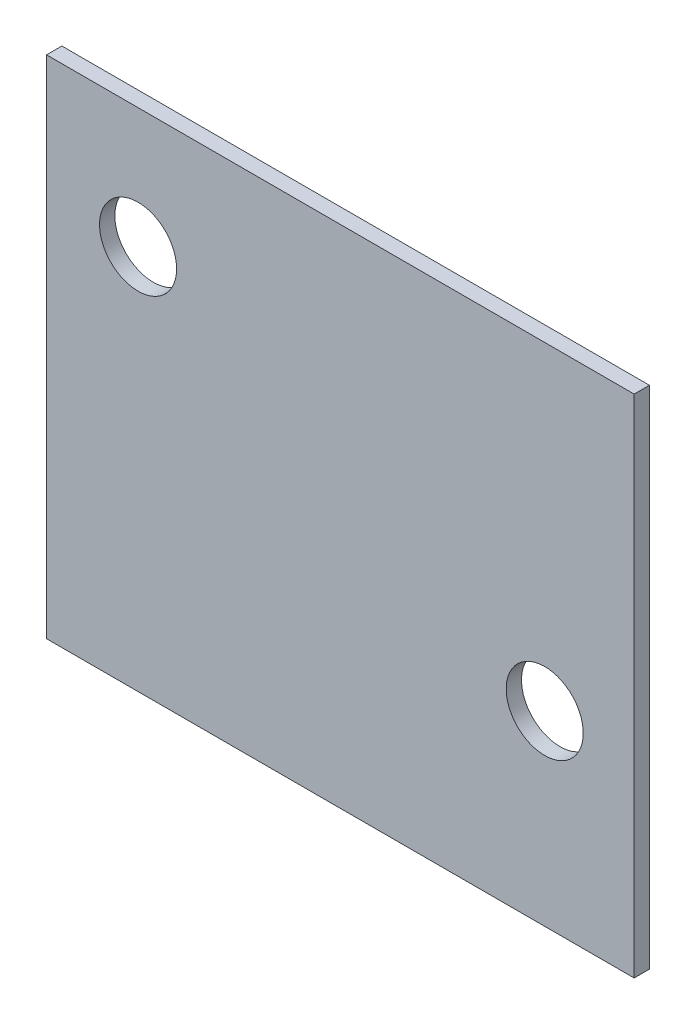
ISO-10303-21;
HEADER;
FILE_DESCRIPTION(('STEP AP214'),'2;1');
FILE_NAME('part.step','',(''),(''),'','','');
FILE_SCHEMA(('AUTOMOTIVE_DESIGN { 1 0 10303 214 1 1 1 1 }'));
ENDSEC;
DATA;
#1=APPLICATION_CONTEXT('core data for automotive mechanical design processes');
#2=APPLICATION_PROTOCOL_DEFINITION('international standard','automotive_design',2000,#1);
#3=PRODUCT_CONTEXT('',#1,'mechanical');
#4=PRODUCT('Part','Part','',(#3));
#5=PRODUCT_RELATED_PRODUCT_CATEGORY('part','',(#4));
#6=PRODUCT_DEFINITION_FORMATION('','',#4);
#7=PRODUCT_DEFINITION_CONTEXT('part definition',#1,'design');
#8=PRODUCT_DEFINITION('design','',#6,#7);
#9=PRODUCT_DEFINITION_SHAPE('','',#8);
#10=(LENGTH_UNIT() NAMED_UNIT(*) SI_UNIT(.MILLI.,.METRE.));
#11=(NAMED_UNIT(*) PLANE_ANGLE_UNIT() SI_UNIT($,.RADIAN.));
#12=(NAMED_UNIT(*) SI_UNIT($,.STERADIAN.) SOLID_ANGLE_UNIT());
#13=UNCERTAINTY_MEASURE_WITH_UNIT(LENGTH_MEASURE(1.E-05),#10,'distance_accuracy_value','');
#14=(GEOMETRIC_REPRESENTATION_CONTEXT(3) GLOBAL_UNCERTAINTY_ASSIGNED_CONTEXT((#13)) GLOBAL_UNIT_ASSIGNED_CONTEXT((#10,
#11,#12)) REPRESENTATION_CONTEXT('',''));
#15=CARTESIAN_POINT('',(0.,0.,0.));
#16=DIRECTION('',(0.,0.,1.));
#17=DIRECTION('',(1.,0.,0.));
#18=AXIS2_PLACEMENT_3D('',#15,#16,#17);
#19=CARTESIAN_POINT('',(103.,-80.,-3.175));
#20=DIRECTION('',(1.,0.,0.));
#21=DIRECTION('',(0.,0.,-1.));
#22=AXIS2_PLACEMENT_3D('',#19,#20,#21);
#23=PLANE('',#22);
#24=DIRECTION('',(0.,1.,0.));
#25=VECTOR('',#24,1.);
#26=CARTESIAN_POINT('',(103.,-80.,0.));
#27=LINE('',#26,#25);
#28=CARTESIAN_POINT('',(103.,-80.,0.));
#29=VERTEX_POINT('',#28);
#30=CARTESIAN_POINT('',(103.,24.9999999999998,0.));
#31=VERTEX_POINT('',#30);
#32=EDGE_CURVE('E98',#29,#31,#27,.T.);
#33=ORIENTED_EDGE('',*,*,#32,.F.);
#34=DIRECTION('',(0.,0.,1.));
#35=VECTOR('',#34,1.);
#36=CARTESIAN_POINT('',(103.,-80.,-3.175));
#37=LINE('',#36,#35);
#38=CARTESIAN_POINT('',(103.,-80.,-3.175));
#39=VERTEX_POINT('',#38);
#40=EDGE_CURVE('E11',#39,#29,#37,.T.);
#41=ORIENTED_EDGE('',*,*,#40,.F.);
#42=DIRECTION('',(0.,1.,0.));
#43=VECTOR('',#42,1.);
#44=CARTESIAN_POINT('',(103.,-80.,-3.175));
#45=LINE('',#44,#43);
#46=CARTESIAN_POINT('',(103.,24.9999999999998,-3.175));
#47=VERTEX_POINT('',#46);
#48=EDGE_CURVE('E91',#39,#47,#45,.T.);
#49=ORIENTED_EDGE('',*,*,#48,.T.);
#50=DIRECTION('',(0.,0.,1.));
#51=VECTOR('',#50,1.);
#52=CARTESIAN_POINT('',(103.,24.9999999999998,-3.175));
#53=LINE('',#52,#51);
#54=EDGE_CURVE('E36',#47,#31,#53,.T.);
#55=ORIENTED_EDGE('',*,*,#54,.T.);
#56=EDGE_LOOP('',(#33,#41,#49,#55));
#57=FACE_BOUND('',#56,.T.);
#58=ADVANCED_FACE('F33',(#57),#23,.T.);
#59=CARTESIAN_POINT('',(103.,-80.,-3.175));
#60=DIRECTION('',(0.,-1.,0.));
#61=DIRECTION('',(1.,0.,0.));
#62=AXIS2_PLACEMENT_3D('',#59,#60,#61);
#63=PLANE('',#62);
#64=DIRECTION('',(1.,0.,0.));
#65=VECTOR('',#64,1.);
#66=CARTESIAN_POINT('',(103.,-80.,0.));
#67=LINE('',#66,#65);
#68=CARTESIAN_POINT('',(-19.,-80.,0.));
#69=VERTEX_POINT('',#68);
#70=EDGE_CURVE('E93',#69,#29,#67,.T.);
#71=ORIENTED_EDGE('',*,*,#70,.F.);
#72=DIRECTION('',(0.,0.,1.));
#73=VECTOR('',#72,1.);
#74=CARTESIAN_POINT('',(-19.,-80.,-3.175));
#75=LINE('',#74,#73);
#76=CARTESIAN_POINT('',(-19.,-80.,-3.175));
#77=VERTEX_POINT('',#76);
#78=EDGE_CURVE('E42',#77,#69,#75,.T.);
#79=ORIENTED_EDGE('',*,*,#78,.F.);
#80=DIRECTION('',(1.,0.,0.));
#81=VECTOR('',#80,1.);
#82=CARTESIAN_POINT('',(103.,-80.,-3.175));
#83=LINE('',#82,#81);
#84=EDGE_CURVE('E88',#77,#39,#83,.T.);
#85=ORIENTED_EDGE('',*,*,#84,.T.);
#86=ORIENTED_EDGE('',*,*,#40,.T.);
#87=EDGE_LOOP('',(#71,#79,#85,#86));
#88=FACE_BOUND('',#87,.T.);
#89=ADVANCED_FACE('F109',(#88),#63,.T.);
#90=CARTESIAN_POINT('',(-19.,-80.,-3.175));
#91=DIRECTION('',(-1.,0.,0.));
#92=DIRECTION('',(0.,-1.,0.));
#93=AXIS2_PLACEMENT_3D('',#90,#91,#92);
#94=PLANE('',#93);
#95=DIRECTION('',(0.,-1.,0.));
#96=VECTOR('',#95,1.);
#97=CARTESIAN_POINT('',(-19.,-80.,0.));
#98=LINE('',#97,#96);
#99=CARTESIAN_POINT('',(-19.,24.9999999999998,0.));
#100=VERTEX_POINT('',#99);
#101=EDGE_CURVE('E83',#100,#69,#98,.T.);
#102=ORIENTED_EDGE('',*,*,#101,.F.);
#103=DIRECTION('',(0.,0.,1.));
#104=VECTOR('',#103,1.);
#105=CARTESIAN_POINT('',(-19.,24.9999999999998,-3.175));
#106=LINE('',#105,#104);
#107=CARTESIAN_POINT('',(-19.,24.9999999999998,-3.175));
#108=VERTEX_POINT('',#107);
#109=EDGE_CURVE('E78',#108,#100,#106,.T.);
#110=ORIENTED_EDGE('',*,*,#109,.F.);
#111=DIRECTION('',(0.,-1.,0.));
#112=VECTOR('',#111,1.);
#113=CARTESIAN_POINT('',(-19.,-80.,-3.175));
#114=LINE('',#113,#112);
#115=EDGE_CURVE('E81',#108,#77,#114,.T.);
#116=ORIENTED_EDGE('',*,*,#115,.T.);
#117=ORIENTED_EDGE('',*,*,#78,.T.);
#118=EDGE_LOOP('',(#102,#110,#116,#117));
#119=FACE_BOUND('',#118,.T.);
#120=ADVANCED_FACE('F80',(#119),#94,.T.);
#121=CARTESIAN_POINT('',(103.,24.9999999999998,-3.175));
#122=DIRECTION('',(0.,1.,0.));
#123=DIRECTION('',(-1.,0.,0.));
#124=AXIS2_PLACEMENT_3D('',#121,#122,#123);
#125=PLANE('',#124);
#126=DIRECTION('',(-1.,0.,0.));
#127=VECTOR('',#126,1.);
#128=CARTESIAN_POINT('',(103.,24.9999999999998,0.));
#129=LINE('',#128,#127);
#130=EDGE_CURVE('E101',#31,#100,#129,.T.);
#131=ORIENTED_EDGE('',*,*,#130,.F.);
#132=ORIENTED_EDGE('',*,*,#54,.F.);
#133=DIRECTION('',(-1.,0.,0.));
#134=VECTOR('',#133,1.);
#135=CARTESIAN_POINT('',(103.,24.9999999999998,-3.175));
#136=LINE('',#135,#134);
#137=EDGE_CURVE('E87',#47,#108,#136,.T.);
#138=ORIENTED_EDGE('',*,*,#137,.T.);
#139=ORIENTED_EDGE('',*,*,#109,.T.);
#140=EDGE_LOOP('',(#131,#132,#138,#139));
#141=FACE_BOUND('',#140,.T.);
#142=ADVANCED_FACE('F90',(#141),#125,.T.);
#143=CARTESIAN_POINT('',(0.,0.,-3.175));
#144=DIRECTION('',(0.,0.,1.));
#145=DIRECTION('',(1.,0.,0.));
#146=AXIS2_PLACEMENT_3D('',#143,#144,#145);
#147=PLANE('',#146);
#148=CARTESIAN_POINT('',(0.,-1.66533453693773E-13,-3.175));
#149=DIRECTION('',(0.,0.,1.));
#150=DIRECTION('',(1.,0.,0.));
#151=AXIS2_PLACEMENT_3D('',#148,#149,#150);
#152=CIRCLE('',#151,8.);
#153=CARTESIAN_POINT('',(8.00000000000003,-1.66533453693773E-13,-3.175));
#154=VERTEX_POINT('',#153);
#155=EDGE_CURVE('E142',#154,#154,#152,.T.);
#156=ORIENTED_EDGE('',*,*,#155,.T.);
#157=EDGE_LOOP('',(#156));
#158=FACE_BOUND('',#157,.T.);
#159=CARTESIAN_POINT('',(84.4311244447171,-41.2750000000001,-3.175));
#160=DIRECTION('',(0.,0.,1.));
#161=DIRECTION('',(1.,0.,0.));
#162=AXIS2_PLACEMENT_3D('',#159,#160,#161);
#163=CIRCLE('',#162,8.00000000000003);
#164=CARTESIAN_POINT('',(92.4311244447171,-41.2750000000001,-3.175));
#165=VERTEX_POINT('',#164);
#166=EDGE_CURVE('E102',#165,#165,#163,.T.);
#167=ORIENTED_EDGE('',*,*,#166,.T.);
#168=EDGE_LOOP('',(#167));
#169=FACE_BOUND('',#168,.T.);
#170=ORIENTED_EDGE('',*,*,#48,.F.);
#171=ORIENTED_EDGE('',*,*,#84,.F.);
#172=ORIENTED_EDGE('',*,*,#115,.F.);
#173=ORIENTED_EDGE('',*,*,#137,.F.);
#174=EDGE_LOOP('',(#170,#171,#172,#173));
#175=FACE_BOUND('',#174,.T.);
#176=ADVANCED_FACE('F86',(#158,#169,#175),#147,.F.);
#177=CARTESIAN_POINT('',(0.,0.,0.));
#178=DIRECTION('',(0.,0.,1.));
#179=DIRECTION('',(1.,0.,0.));
#180=AXIS2_PLACEMENT_3D('',#177,#178,#179);
#181=PLANE('',#180);
#182=CARTESIAN_POINT('',(0.,-1.66533453693773E-13,0.));
#183=DIRECTION('',(0.,0.,1.));
#184=DIRECTION('',(1.,0.,0.));
#185=AXIS2_PLACEMENT_3D('',#182,#183,#184);
#186=CIRCLE('',#185,8.);
#187=CARTESIAN_POINT('',(8.00000000000003,-1.66533453693773E-13,0.));
#188=VERTEX_POINT('',#187);
#189=EDGE_CURVE('E145',#188,#188,#186,.T.);
#190=ORIENTED_EDGE('',*,*,#189,.F.);
#191=EDGE_LOOP('',(#190));
#192=FACE_BOUND('',#191,.T.);
#193=CARTESIAN_POINT('',(84.4311244447171,-41.2750000000001,0.));
#194=DIRECTION('',(0.,0.,1.));
#195=DIRECTION('',(1.,0.,0.));
#196=AXIS2_PLACEMENT_3D('',#193,#194,#195);
#197=CIRCLE('',#196,8.00000000000003);
#198=CARTESIAN_POINT('',(92.4311244447171,-41.2750000000001,0.));
#199=VERTEX_POINT('',#198);
#200=EDGE_CURVE('E147',#199,#199,#197,.T.);
#201=ORIENTED_EDGE('',*,*,#200,.F.);
#202=EDGE_LOOP('',(#201));
#203=FACE_BOUND('',#202,.T.);
#204=ORIENTED_EDGE('',*,*,#32,.T.);
#205=ORIENTED_EDGE('',*,*,#130,.T.);
#206=ORIENTED_EDGE('',*,*,#101,.T.);
#207=ORIENTED_EDGE('',*,*,#70,.T.);
#208=EDGE_LOOP('',(#204,#205,#206,#207));
#209=FACE_BOUND('',#208,.T.);
#210=ADVANCED_FACE('F108',(#192,#203,#209),#181,.T.);
#211=CARTESIAN_POINT('',(84.4311244447171,-41.2750000000001,-3.175));
#212=DIRECTION('',(0.,0.,1.));
#213=DIRECTION('',(1.,0.,0.));
#214=AXIS2_PLACEMENT_3D('',#211,#212,#213);
#215=CYLINDRICAL_SURFACE('',#214,8.00000000000003);
#216=ORIENTED_EDGE('',*,*,#166,.F.);
#217=EDGE_LOOP('',(#216));
#218=FACE_BOUND('',#217,.T.);
#219=ORIENTED_EDGE('',*,*,#200,.T.);
#220=EDGE_LOOP('',(#219));
#221=FACE_BOUND('',#220,.T.);
#222=ADVANCED_FACE('F127',(#218,#221),#215,.F.);
#223=CARTESIAN_POINT('',(0.,-1.66533453693773E-13,-3.175));
#224=DIRECTION('',(0.,0.,1.));
#225=DIRECTION('',(1.,0.,0.));
#226=AXIS2_PLACEMENT_3D('',#223,#224,#225);
#227=CYLINDRICAL_SURFACE('',#226,8.);
#228=ORIENTED_EDGE('',*,*,#155,.F.);
#229=EDGE_LOOP('',(#228));
#230=FACE_BOUND('',#229,.T.);
#231=ORIENTED_EDGE('',*,*,#189,.T.);
#232=EDGE_LOOP('',(#231));
#233=FACE_BOUND('',#232,.T.);
#234=ADVANCED_FACE('F134',(#230,#233),#227,.F.);
#235=CLOSED_SHELL('',(#58,#89,#120,#142,#176,#210,#222,#234));
#236=MANIFOLD_SOLID_BREP('B2',#235);
#237=ADVANCED_BREP_SHAPE_REPRESENTATION('',(#18,#236),#14);
#238=SHAPE_DEFINITION_REPRESENTATION(#9,#237);
ENDSEC;
END-ISO-10303-21;
